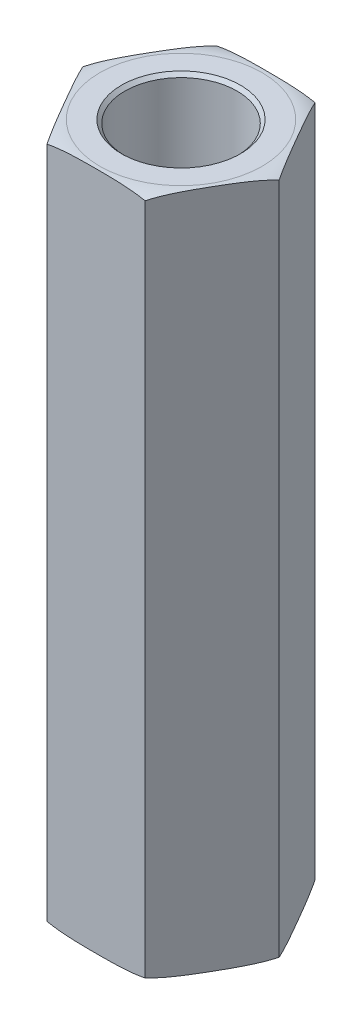
ISO-10303-21;
HEADER;
FILE_DESCRIPTION(('STEP AP214'),'2;1');
FILE_NAME('part.step','',(''),(''),'','','');
FILE_SCHEMA(('AUTOMOTIVE_DESIGN { 1 0 10303 214 1 1 1 1 }'));
ENDSEC;
DATA;
#1=APPLICATION_CONTEXT('core data for automotive mechanical design processes');
#2=APPLICATION_PROTOCOL_DEFINITION('international standard','automotive_design',2000,#1);
#3=PRODUCT_CONTEXT('',#1,'mechanical');
#4=PRODUCT('Part','Part','',(#3));
#5=PRODUCT_RELATED_PRODUCT_CATEGORY('part','',(#4));
#6=PRODUCT_DEFINITION_FORMATION('','',#4);
#7=PRODUCT_DEFINITION_CONTEXT('part definition',#1,'design');
#8=PRODUCT_DEFINITION('design','',#6,#7);
#9=PRODUCT_DEFINITION_SHAPE('','',#8);
#10=(LENGTH_UNIT() NAMED_UNIT(*) SI_UNIT(.MILLI.,.METRE.));
#11=(NAMED_UNIT(*) PLANE_ANGLE_UNIT() SI_UNIT($,.RADIAN.));
#12=(NAMED_UNIT(*) SI_UNIT($,.STERADIAN.) SOLID_ANGLE_UNIT());
#13=UNCERTAINTY_MEASURE_WITH_UNIT(LENGTH_MEASURE(1.E-05),#10,'distance_accuracy_value','');
#14=(GEOMETRIC_REPRESENTATION_CONTEXT(3) GLOBAL_UNCERTAINTY_ASSIGNED_CONTEXT((#13)) GLOBAL_UNIT_ASSIGNED_CONTEXT((#10,
#11,#12)) REPRESENTATION_CONTEXT('',''));
#15=CARTESIAN_POINT('',(0.,0.,0.));
#16=DIRECTION('',(0.,0.,1.));
#17=DIRECTION('',(1.,0.,0.));
#18=AXIS2_PLACEMENT_3D('',#15,#16,#17);
#19=CARTESIAN_POINT('',(3.66617420935412,12.7,0.));
#20=DIRECTION('',(-0.866025403784439,0.,0.5));
#21=DIRECTION('',(0.5,0.,0.866025403784439));
#22=AXIS2_PLACEMENT_3D('',#19,#20,#21);
#23=PLANE('',#22);
#24=DIRECTION('',(0.,1.,0.));
#25=VECTOR('',#24,1.);
#26=CARTESIAN_POINT('',(1.83308710467704,12.7,-3.175));
#27=LINE('',#26,#25);
#28=CARTESIAN_POINT('',(1.83308710467705,-12.573,-3.175));
#29=VERTEX_POINT('',#28);
#30=CARTESIAN_POINT('',(1.83308710467706,12.573,-3.175));
#31=VERTEX_POINT('',#30);
#32=EDGE_CURVE('E144',#29,#31,#27,.T.);
#33=ORIENTED_EDGE('',*,*,#32,.T.);
#34=CARTESIAN_POINT('',(3.66617420935412,12.573,0.));
#35=CARTESIAN_POINT('',(3.62797961467394,12.5889014148997,-0.0661549785605585));
#36=CARTESIAN_POINT('',(3.58956810864157,12.6024886076105,-0.132685658603878));
#37=CARTESIAN_POINT('',(3.5124905179571,12.6258161979402,-0.266187961794366));
#38=CARTESIAN_POINT('',(3.47382473049846,12.6355604771397,-0.333159070187399));
#39=CARTESIAN_POINT('',(3.39641631867872,12.6519966530451,-0.467234372392395));
#40=CARTESIAN_POINT('',(3.35767399633311,12.6586945328669,-0.534338043098201));
#41=CARTESIAN_POINT('',(3.28009834620112,12.6697767572932,-0.668703010557003));
#42=CARTESIAN_POINT('',(3.2412649958777,12.674160450474,-0.735964346345292));
#43=CARTESIAN_POINT('',(3.16354065964313,12.6812403004263,-0.870586845688127));
#44=CARTESIAN_POINT('',(3.12464965374474,12.6839355237591,-0.9379480438616));
#45=CARTESIAN_POINT('',(3.04685144594591,12.6881531983713,-1.07269849250698));
#46=CARTESIAN_POINT('',(3.00794424351967,12.6896756080272,-1.14008774388959));
#47=CARTESIAN_POINT('',(2.93051517598871,12.691922705889,-1.2741988228359));
#48=CARTESIAN_POINT('',(2.89199336248932,12.6926552468181,-1.34092056101654));
#49=CARTESIAN_POINT('',(2.8149477834614,12.6935767302574,-1.47436741839144));
#50=CARTESIAN_POINT('',(2.77642401791436,12.6937656658949,-1.5410925376178));
#51=CARTESIAN_POINT('',(2.69935964431009,12.6936659966806,-1.67457194815386));
#52=CARTESIAN_POINT('',(2.66081903631818,12.6933771811766,-1.74132623935045));
#53=CARTESIAN_POINT('',(2.58373908085326,12.692221986219,-1.87483263846084));
#54=CARTESIAN_POINT('',(2.54519973341241,12.6913555970386,-1.94158474631893));
#55=CARTESIAN_POINT('',(2.46812969629766,12.6887861940656,-2.0750739663429));
#56=CARTESIAN_POINT('',(2.42959900625961,12.6870832271617,-2.1418110791395));
#57=CARTESIAN_POINT('',(2.35255651340904,12.6824387229726,-2.27525259109845));
#58=CARTESIAN_POINT('',(2.31404470975438,12.6794972471358,-2.34195699171943));
#59=CARTESIAN_POINT('',(2.2508420623994,12.6732174124749,-2.45142718811111));
#60=CARTESIAN_POINT('',(2.22613849337005,12.6703980110463,-2.49421502479823));
#61=CARTESIAN_POINT('',(2.17676945272224,12.6638696794304,-2.57972471152118));
#62=CARTESIAN_POINT('',(2.1521039703418,12.6601610809139,-2.6224465801973));
#63=CARTESIAN_POINT('',(2.10282753811693,12.6516802711497,-2.7077958644265));
#64=CARTESIAN_POINT('',(2.07821657107526,12.6469084657008,-2.75042330976607));
#65=CARTESIAN_POINT('',(2.02900094683547,12.6360987712516,-2.8356672714756));
#66=CARTESIAN_POINT('',(2.00439646085461,12.6300577313084,-2.87828349128856));
#67=CARTESIAN_POINT('',(1.95527325900932,12.6165138354161,-2.96336737271507));
#68=CARTESIAN_POINT('',(1.93075459617613,12.609010197803,-3.00583494247581));
#69=CARTESIAN_POINT('',(1.8818215737317,12.5923203507084,-3.09058942351746));
#70=CARTESIAN_POINT('',(1.85740744053269,12.5831314978033,-3.13287594264091));
#71=CARTESIAN_POINT('',(1.83308710467706,12.573,-3.175));
#72=B_SPLINE_CURVE_WITH_KNOTS('',3,(#34,#35,#36,#37,#38,#39,#40,#41,#42,#43,#44,#45,#46,#47,#48,
#49,#50,#51,#52,#53,#54,#55,#56,#57,#58,#59,#60,#61,#62,#63,#64,#65,#66,#67,#68,#69,#70,#71),
.UNSPECIFIED.,.F.,.F.,(4,2,2,2,2,2,2,2,2,2,2,2,2,2,2,2,2,2,4),(0.,0.233977307817949,
0.467717675040708,0.700996973557522,0.934341903229779,1.16781571967243,1.40129782179829,
1.63243665809675,1.86357841666623,2.09482211846301,2.32606971471502,2.55730435147406,
2.78852751694422,2.93698369265095,3.0853845800448,3.23372892334589,3.38244598546616,
3.53124274626086,3.68027493713586),.UNSPECIFIED.);
#73=CARTESIAN_POINT('',(3.66617420935412,12.573,0.));
#74=VERTEX_POINT('',#73);
#75=EDGE_CURVE('E96',#74,#31,#72,.T.);
#76=ORIENTED_EDGE('',*,*,#75,.F.);
#77=DIRECTION('',(0.,1.,0.));
#78=VECTOR('',#77,1.);
#79=CARTESIAN_POINT('',(3.66617420935412,12.7,0.));
#80=LINE('',#79,#78);
#81=CARTESIAN_POINT('',(3.66617420935412,-12.573,0.));
#82=VERTEX_POINT('',#81);
#83=EDGE_CURVE('E146',#74,#82,#80,.F.);
#84=ORIENTED_EDGE('',*,*,#83,.T.);
#85=CARTESIAN_POINT('',(1.83308710467705,-12.573,-3.17500000000001));
#86=CARTESIAN_POINT('',(1.87128169935723,-12.5889014148997,-3.10884502143945));
#87=CARTESIAN_POINT('',(1.9096932053896,-12.6024886076105,-3.04231434139613));
#88=CARTESIAN_POINT('',(1.98677079607407,-12.6258161979402,-2.90881203820565));
#89=CARTESIAN_POINT('',(2.02543658353271,-12.6355604771397,-2.84184092981261));
#90=CARTESIAN_POINT('',(2.10284499535244,-12.6519966530451,-2.70776562760762));
#91=CARTESIAN_POINT('',(2.14158731769805,-12.6586945328669,-2.64066195690182));
#92=CARTESIAN_POINT('',(2.21916296783004,-12.6697767572932,-2.50629698944302));
#93=CARTESIAN_POINT('',(2.25799631815347,-12.674160450474,-2.43903565365473));
#94=CARTESIAN_POINT('',(2.33572065438803,-12.6812403004263,-2.3044131543119));
#95=CARTESIAN_POINT('',(2.37461166028642,-12.6839355237591,-2.23705195613842));
#96=CARTESIAN_POINT('',(2.45240986808525,-12.6881531983713,-2.10230150749305));
#97=CARTESIAN_POINT('',(2.49131707051149,-12.6896756080272,-2.03491225611044));
#98=CARTESIAN_POINT('',(2.56874613804245,-12.691922705889,-1.90080117716413));
#99=CARTESIAN_POINT('',(2.60726795154184,-12.6926552468181,-1.8340794389835));
#100=CARTESIAN_POINT('',(2.68431353056975,-12.6935767302574,-1.70063258160859));
#101=CARTESIAN_POINT('',(2.72283729611679,-12.6937656658949,-1.63390746238224));
#102=CARTESIAN_POINT('',(2.79990166972106,-12.6936659966806,-1.50042805184618));
#103=CARTESIAN_POINT('',(2.83844227771297,-12.6933771811766,-1.43367376064959));
#104=CARTESIAN_POINT('',(2.91552223317789,-12.692221986219,-1.30016736153921));
#105=CARTESIAN_POINT('',(2.95406158061874,-12.6913555970386,-1.23341525368111));
#106=CARTESIAN_POINT('',(3.03113161773348,-12.6887861940656,-1.09992603365715));
#107=CARTESIAN_POINT('',(3.06966230777154,-12.6870832271617,-1.03318892086055));
#108=CARTESIAN_POINT('',(3.14670480062211,-12.6824387229726,-0.899747408901607));
#109=CARTESIAN_POINT('',(3.18521660427677,-12.6794972471358,-0.833043008280621));
#110=CARTESIAN_POINT('',(3.24841925163175,-12.6732174124749,-0.723572811888938));
#111=CARTESIAN_POINT('',(3.27312282066109,-12.6703980110463,-0.680784975201824));
#112=CARTESIAN_POINT('',(3.32249186130891,-12.6638696794304,-0.595275288478867));
#113=CARTESIAN_POINT('',(3.34715734368935,-12.6601610809139,-0.552553419802744));
#114=CARTESIAN_POINT('',(3.39643377591423,-12.6516802711497,-0.467204135573539));
#115=CARTESIAN_POINT('',(3.4210447429559,-12.6469084657008,-0.424576690233965));
#116=CARTESIAN_POINT('',(3.47026036719569,-12.6360987712516,-0.339332728524428));
#117=CARTESIAN_POINT('',(3.49486485317655,-12.6300577313084,-0.296716508711459));
#118=CARTESIAN_POINT('',(3.54398805502185,-12.6165138354161,-0.211632627284942));
#119=CARTESIAN_POINT('',(3.56850671785504,-12.609010197803,-0.169165057524202));
#120=CARTESIAN_POINT('',(3.61743974029947,-12.5923203507084,-0.0844105764825456));
#121=CARTESIAN_POINT('',(3.64185387349848,-12.5831314978033,-0.0421240573590982));
#122=CARTESIAN_POINT('',(3.66617420935412,-12.573,0.));
#123=B_SPLINE_CURVE_WITH_KNOTS('',3,(#85,#86,#87,#88,#89,#90,#91,#92,#93,#94,#95,#96,#97,#98,
#99,#100,#101,#102,#103,#104,#105,#106,#107,#108,#109,#110,#111,#112,#113,#114,#115,#116,#117,
#118,#119,#120,#121,#122),.UNSPECIFIED.,.F.,.F.,(4,2,2,2,2,2,2,2,2,2,2,2,2,2,2,2,2,2,4),(0.,
0.233977307817944,0.467717675040699,0.700996973557508,0.934341903229761,1.16781571967241,
1.40129782179826,1.63243665809671,1.86357841666619,2.09482211846297,2.32606971471497,
2.55730435147401,2.78852751694416,2.9369836926509,3.08538458004476,3.23372892334587,
3.38244598546614,3.53124274626085,3.68027493713586),.UNSPECIFIED.);
#124=EDGE_CURVE('E224',#29,#82,#123,.T.);
#125=ORIENTED_EDGE('',*,*,#124,.F.);
#126=EDGE_LOOP('',(#33,#76,#84,#125));
#127=FACE_BOUND('',#126,.T.);
#128=ADVANCED_FACE('F16',(#127),#23,.F.);
#129=CARTESIAN_POINT('',(1.83308710467706,12.7,3.17499999999999));
#130=DIRECTION('',(-0.866025403784439,0.,-0.5));
#131=DIRECTION('',(-0.5,0.,0.866025403784439));
#132=AXIS2_PLACEMENT_3D('',#129,#130,#131);
#133=PLANE('',#132);
#134=ORIENTED_EDGE('',*,*,#83,.F.);
#135=CARTESIAN_POINT('',(1.83308710467706,12.573,3.17499999999999));
#136=CARTESIAN_POINT('',(1.87128169935724,12.5889014148997,3.10884502143943));
#137=CARTESIAN_POINT('',(1.90969320538962,12.6024886076105,3.04231434139611));
#138=CARTESIAN_POINT('',(1.98677079607408,12.6258161979402,2.90881203820562));
#139=CARTESIAN_POINT('',(2.02543658353273,12.6355604771397,2.84184092981259));
#140=CARTESIAN_POINT('',(2.10284499535246,12.6519966530451,2.7077656276076));
#141=CARTESIAN_POINT('',(2.14158731769807,12.6586945328669,2.64066195690179));
#142=CARTESIAN_POINT('',(2.21916296783006,12.6697767572932,2.50629698944299));
#143=CARTESIAN_POINT('',(2.25799631815349,12.674160450474,2.4390356536547));
#144=CARTESIAN_POINT('',(2.33572065438805,12.6812403004263,2.30441315431186));
#145=CARTESIAN_POINT('',(2.37461166028644,12.6839355237591,2.23705195613839));
#146=CARTESIAN_POINT('',(2.45240986808528,12.6881531983713,2.10230150749301));
#147=CARTESIAN_POINT('',(2.49131707051151,12.6896756080272,2.0349122561104));
#148=CARTESIAN_POINT('',(2.56874613804248,12.691922705889,1.90080117716409));
#149=CARTESIAN_POINT('',(2.60726795154187,12.6926552468181,1.83407943898345));
#150=CARTESIAN_POINT('',(2.68431353056978,12.6935767302574,1.70063258160855));
#151=CARTESIAN_POINT('',(2.72283729611682,12.6937656658949,1.63390746238219));
#152=CARTESIAN_POINT('',(2.79990166972109,12.6936659966806,1.50042805184613));
#153=CARTESIAN_POINT('',(2.83844227771301,12.6933771811766,1.43367376064954));
#154=CARTESIAN_POINT('',(2.91552223317792,12.692221986219,1.30016736153915));
#155=CARTESIAN_POINT('',(2.95406158061877,12.6913555970386,1.23341525368106));
#156=CARTESIAN_POINT('',(3.03113161773352,12.6887861940656,1.09992603365709));
#157=CARTESIAN_POINT('',(3.06966230777158,12.6870832271617,1.03318892086049));
#158=CARTESIAN_POINT('',(3.14670480062214,12.6824387229726,0.899747408901544));
#159=CARTESIAN_POINT('',(3.1852166042768,12.6794972471358,0.833043008280556));
#160=CARTESIAN_POINT('',(3.24841925163178,12.6732174124749,0.723572811888876));
#161=CARTESIAN_POINT('',(3.27312282066113,12.6703980110463,0.680784975201767));
#162=CARTESIAN_POINT('',(3.32249186130894,12.6638696794304,0.595275288478818));
#163=CARTESIAN_POINT('',(3.34715734368938,12.6601610809139,0.552553419802699));
#164=CARTESIAN_POINT('',(3.39643377591425,12.6516802711497,0.467204135573501));
#165=CARTESIAN_POINT('',(3.42104474295592,12.6469084657008,0.424576690233932));
#166=CARTESIAN_POINT('',(3.47026036719571,12.6360987712516,0.339332728524402));
#167=CARTESIAN_POINT('',(3.49486485317657,12.6300577313084,0.296716508711437));
#168=CARTESIAN_POINT('',(3.54398805502186,12.6165138354161,0.211632627284927));
#169=CARTESIAN_POINT('',(3.56850671785505,12.609010197803,0.169165057524192));
#170=CARTESIAN_POINT('',(3.61743974029947,12.5923203507084,0.0844105764825436));
#171=CARTESIAN_POINT('',(3.64185387349848,12.5831314978033,0.0421240573591002));
#172=CARTESIAN_POINT('',(3.66617420935412,12.573,0.));
#173=B_SPLINE_CURVE_WITH_KNOTS('',3,(#135,#136,#137,#138,#139,#140,#141,#142,#143,#144,#145,
#146,#147,#148,#149,#150,#151,#152,#153,#154,#155,#156,#157,#158,#159,#160,#161,#162,#163,#164,
#165,#166,#167,#168,#169,#170,#171,#172),.UNSPECIFIED.,.F.,.F.,(4,2,2,2,2,2,2,2,2,2,2,2,2,2,2,2,
2,2,4),(0.,0.23397730781795,0.467717675040709,0.700996973557522,0.93434190322978,
1.16781571967243,1.40129782179829,1.63243665809675,1.86357841666623,2.09482211846301,
2.32606971471502,2.55730435147406,2.78852751694422,2.93698369265095,3.08538458004479,
3.23372892334589,3.38244598546615,3.53124274626085,3.68027493713584),.UNSPECIFIED.);
#174=CARTESIAN_POINT('',(1.83308710467706,12.573,3.17499999999999));
#175=VERTEX_POINT('',#174);
#176=EDGE_CURVE('E217',#175,#74,#173,.T.);
#177=ORIENTED_EDGE('',*,*,#176,.F.);
#178=DIRECTION('',(0.,1.,0.));
#179=VECTOR('',#178,1.);
#180=CARTESIAN_POINT('',(1.83308710467706,12.7,3.17499999999999));
#181=LINE('',#180,#179);
#182=CARTESIAN_POINT('',(1.83308710467706,-12.573,3.17499999999999));
#183=VERTEX_POINT('',#182);
#184=EDGE_CURVE('E141',#175,#183,#181,.F.);
#185=ORIENTED_EDGE('',*,*,#184,.T.);
#186=CARTESIAN_POINT('',(3.66617420935412,-12.573,0.));
#187=CARTESIAN_POINT('',(3.62797961467394,-12.5889014148997,0.0661549785605638));
#188=CARTESIAN_POINT('',(3.58956810864156,-12.6024886076105,0.132685658603883));
#189=CARTESIAN_POINT('',(3.5124905179571,-12.6258161979402,0.266187961794371));
#190=CARTESIAN_POINT('',(3.47382473049846,-12.6355604771397,0.333159070187405));
#191=CARTESIAN_POINT('',(3.39641631867872,-12.6519966530451,0.467234372392401));
#192=CARTESIAN_POINT('',(3.35767399633311,-12.6586945328669,0.534338043098206));
#193=CARTESIAN_POINT('',(3.28009834620112,-12.6697767572932,0.668703010557008));
#194=CARTESIAN_POINT('',(3.2412649958777,-12.674160450474,0.735964346345298));
#195=CARTESIAN_POINT('',(3.16354065964313,-12.6812403004263,0.870586845688132));
#196=CARTESIAN_POINT('',(3.12464965374474,-12.6839355237591,0.937948043861606));
#197=CARTESIAN_POINT('',(3.0468514459459,-12.6881531983713,1.07269849250699));
#198=CARTESIAN_POINT('',(3.00794424351967,-12.6896756080272,1.1400877438896));
#199=CARTESIAN_POINT('',(2.9305151759887,-12.691922705889,1.27419882283591));
#200=CARTESIAN_POINT('',(2.89199336248931,-12.6926552468181,1.34092056101654));
#201=CARTESIAN_POINT('',(2.8149477834614,-12.6935767302574,1.47436741839145));
#202=CARTESIAN_POINT('',(2.77642401791436,-12.6937656658949,1.5410925376178));
#203=CARTESIAN_POINT('',(2.69935964431009,-12.6936659966806,1.67457194815387));
#204=CARTESIAN_POINT('',(2.66081903631818,-12.6933771811766,1.74132623935046));
#205=CARTESIAN_POINT('',(2.58373908085326,-12.692221986219,1.87483263846084));
#206=CARTESIAN_POINT('',(2.54519973341241,-12.6913555970386,1.94158474631894));
#207=CARTESIAN_POINT('',(2.46812969629766,-12.6887861940656,2.0750739663429));
#208=CARTESIAN_POINT('',(2.4295990062596,-12.6870832271616,2.14181107913951));
#209=CARTESIAN_POINT('',(2.35255651340904,-12.6824387229726,2.27525259109845));
#210=CARTESIAN_POINT('',(2.31404470975437,-12.6794972471358,2.34195699171944));
#211=CARTESIAN_POINT('',(2.2508420623994,-12.6732174124749,2.45142718811112));
#212=CARTESIAN_POINT('',(2.22613849337005,-12.6703980110463,2.49421502479823));
#213=CARTESIAN_POINT('',(2.17676945272224,-12.6638696794304,2.57972471152118));
#214=CARTESIAN_POINT('',(2.1521039703418,-12.6601610809139,2.6224465801973));
#215=CARTESIAN_POINT('',(2.10282753811693,-12.6516802711497,2.7077958644265));
#216=CARTESIAN_POINT('',(2.07821657107526,-12.6469084657008,2.75042330976606));
#217=CARTESIAN_POINT('',(2.02900094683548,-12.6360987712516,2.83566727147559));
#218=CARTESIAN_POINT('',(2.00439646085462,-12.6300577313084,2.87828349128856));
#219=CARTESIAN_POINT('',(1.95527325900932,-12.6165138354161,2.96336737271507));
#220=CARTESIAN_POINT('',(1.93075459617613,-12.609010197803,3.0058349424758));
#221=CARTESIAN_POINT('',(1.88182157373171,-12.5923203507084,3.09058942351745));
#222=CARTESIAN_POINT('',(1.8574074405327,-12.5831314978033,3.1328759426409));
#223=CARTESIAN_POINT('',(1.83308710467706,-12.573,3.17499999999999));
#224=B_SPLINE_CURVE_WITH_KNOTS('',3,(#186,#187,#188,#189,#190,#191,#192,#193,#194,#195,#196,
#197,#198,#199,#200,#201,#202,#203,#204,#205,#206,#207,#208,#209,#210,#211,#212,#213,#214,#215,
#216,#217,#218,#219,#220,#221,#222,#223),.UNSPECIFIED.,.F.,.F.,(4,2,2,2,2,2,2,2,2,2,2,2,2,2,2,2,
2,2,4),(0.,0.233977307817949,0.467717675040709,0.700996973557522,0.93434190322978,
1.16781571967243,1.40129782179829,1.63243665809675,1.86357841666623,2.09482211846301,
2.32606971471502,2.55730435147406,2.78852751694422,2.93698369265095,3.08538458004479,
3.23372892334589,3.38244598546615,3.53124274626085,3.68027493713584),.UNSPECIFIED.);
#225=EDGE_CURVE('E246',#82,#183,#224,.T.);
#226=ORIENTED_EDGE('',*,*,#225,.F.);
#227=EDGE_LOOP('',(#134,#177,#185,#226));
#228=FACE_BOUND('',#227,.T.);
#229=ADVANCED_FACE('F221',(#228),#133,.F.);
#230=CARTESIAN_POINT('',(1.83308710467706,12.7,-3.175));
#231=DIRECTION('',(0.,0.,1.));
#232=DIRECTION('',(1.,0.,0.));
#233=AXIS2_PLACEMENT_3D('',#230,#231,#232);
#234=PLANE('',#233);
#235=DIRECTION('',(0.,1.,0.));
#236=VECTOR('',#235,1.);
#237=CARTESIAN_POINT('',(-1.83308710467707,12.7,-3.175));
#238=LINE('',#237,#236);
#239=CARTESIAN_POINT('',(-1.83308710467707,-12.573,-3.175));
#240=VERTEX_POINT('',#239);
#241=CARTESIAN_POINT('',(-1.83308710467706,12.573,-3.17500000000001));
#242=VERTEX_POINT('',#241);
#243=EDGE_CURVE('E103',#240,#242,#238,.T.);
#244=ORIENTED_EDGE('',*,*,#243,.T.);
#245=CARTESIAN_POINT('',(1.83308710467706,12.573,-3.175));
#246=CARTESIAN_POINT('',(1.73237579828683,12.5939400141518,-3.175));
#247=CARTESIAN_POINT('',(1.63096506893486,12.6108853495327,-3.175));
#248=CARTESIAN_POINT('',(1.42767146651469,12.6384971643984,-3.175));
#249=CARTESIAN_POINT('',(1.32579191427254,12.6491875658753,-3.175));
#250=CARTESIAN_POINT('',(1.12177634709137,12.6661280408079,-3.175));
#251=CARTESIAN_POINT('',(1.0196405664338,12.6723812707189,-3.175));
#252=CARTESIAN_POINT('',(0.815663681397375,12.6819028064183,-3.175));
#253=CARTESIAN_POINT('',(0.713823115514573,12.6851834044999,-3.175));
#254=CARTESIAN_POINT('',(0.510018485441651,12.6899454848703,-3.175));
#255=CARTESIAN_POINT('',(0.408054390577976,12.6914254100882,-3.175));
#256=CARTESIAN_POINT('',(0.20406020033787,12.6933146818379,-3.175));
#257=CARTESIAN_POINT('',(0.102030100168935,12.6937234241492,-3.175));
#258=CARTESIAN_POINT('',(-0.102030100168934,12.6937234241492,-3.175));
#259=CARTESIAN_POINT('',(-0.204060200337869,12.6933146818379,-3.175));
#260=CARTESIAN_POINT('',(-0.408054390577974,12.6914254100882,-3.175));
#261=CARTESIAN_POINT('',(-0.510018485441649,12.6899454848703,-3.175));
#262=CARTESIAN_POINT('',(-0.71382311551457,12.6851834044999,-3.175));
#263=CARTESIAN_POINT('',(-0.815663681397372,12.6819028064183,-3.175));
#264=CARTESIAN_POINT('',(-1.01964056643379,12.6723812707189,-3.175));
#265=CARTESIAN_POINT('',(-1.12177634709137,12.6661280408079,-3.175));
#266=CARTESIAN_POINT('',(-1.32579191427253,12.6491875658753,-3.175));
#267=CARTESIAN_POINT('',(-1.42767146651468,12.6384971643984,-3.175));
#268=CARTESIAN_POINT('',(-1.63096506893485,12.6108853495327,-3.175));
#269=CARTESIAN_POINT('',(-1.73237579828682,12.5939400141518,-3.175));
#270=CARTESIAN_POINT('',(-1.83308710467705,12.573,-3.175));
#271=B_SPLINE_CURVE_WITH_KNOTS('',3,(#245,#246,#247,#248,#249,#250,#251,#252,#253,#254,#255,
#256,#257,#258,#259,#260,#261,#262,#263,#264,#265,#266,#267,#268,#269,#270),.UNSPECIFIED.,.F.,
.F.,(4,2,2,2,2,2,2,2,2,2,2,2,4),(0.,0.308333242342807,0.615479423308234,0.922406891130008,
1.2280592962085,1.53397581645216,1.84006485747889,2.14615389850561,2.45207041874927,
2.75772282382776,3.06465029164953,3.37179647261496,3.68012971495777),.UNSPECIFIED.);
#272=EDGE_CURVE('E88',#31,#242,#271,.T.);
#273=ORIENTED_EDGE('',*,*,#272,.F.);
#274=ORIENTED_EDGE('',*,*,#32,.F.);
#275=CARTESIAN_POINT('',(-1.83308710467707,-12.573,-3.175));
#276=CARTESIAN_POINT('',(-1.73237579828684,-12.5939400141518,-3.175));
#277=CARTESIAN_POINT('',(-1.63096506893487,-12.6108853495327,-3.175));
#278=CARTESIAN_POINT('',(-1.4276714665147,-12.6384971643984,-3.175));
#279=CARTESIAN_POINT('',(-1.32579191427255,-12.6491875658753,-3.175));
#280=CARTESIAN_POINT('',(-1.12177634709138,-12.6661280408079,-3.175));
#281=CARTESIAN_POINT('',(-1.0196405664338,-12.6723812707189,-3.175));
#282=CARTESIAN_POINT('',(-0.81566368139738,-12.6819028064183,-3.175));
#283=CARTESIAN_POINT('',(-0.713823115514577,-12.6851834044999,-3.175));
#284=CARTESIAN_POINT('',(-0.510018485441653,-12.6899454848703,-3.175));
#285=CARTESIAN_POINT('',(-0.408054390577979,-12.6914254100882,-3.175));
#286=CARTESIAN_POINT('',(-0.204060200337872,-12.6933146818379,-3.175));
#287=CARTESIAN_POINT('',(-0.102030100168936,-12.6937234241492,-3.175));
#288=CARTESIAN_POINT('',(0.102030100168934,-12.6937234241492,-3.175));
#289=CARTESIAN_POINT('',(0.204060200337868,-12.6933146818379,-3.175));
#290=CARTESIAN_POINT('',(0.408054390577973,-12.6914254100882,-3.175));
#291=CARTESIAN_POINT('',(0.510018485441647,-12.6899454848703,-3.175));
#292=CARTESIAN_POINT('',(0.713823115514568,-12.6851834044999,-3.175));
#293=CARTESIAN_POINT('',(0.81566368139737,-12.6819028064183,-3.175));
#294=CARTESIAN_POINT('',(1.01964056643379,-12.6723812707189,-3.175));
#295=CARTESIAN_POINT('',(1.12177634709137,-12.6661280408079,-3.175));
#296=CARTESIAN_POINT('',(1.32579191427253,-12.6491875658753,-3.175));
#297=CARTESIAN_POINT('',(1.42767146651468,-12.6384971643984,-3.175));
#298=CARTESIAN_POINT('',(1.63096506893485,-12.6108853495327,-3.175));
#299=CARTESIAN_POINT('',(1.73237579828682,-12.5939400141518,-3.175));
#300=CARTESIAN_POINT('',(1.83308710467705,-12.573,-3.175));
#301=B_SPLINE_CURVE_WITH_KNOTS('',3,(#275,#276,#277,#278,#279,#280,#281,#282,#283,#284,#285,
#286,#287,#288,#289,#290,#291,#292,#293,#294,#295,#296,#297,#298,#299,#300),.UNSPECIFIED.,.F.,
.F.,(4,2,2,2,2,2,2,2,2,2,2,2,4),(0.,0.308333242342808,0.615479423308238,0.922406891130013,
1.22805929620851,1.53397581645217,1.8400648574789,2.14615389850562,2.45207041874928,
2.75772282382777,3.06465029164954,3.37179647261497,3.68012971495777),.UNSPECIFIED.);
#302=EDGE_CURVE('E105',#240,#29,#301,.T.);
#303=ORIENTED_EDGE('',*,*,#302,.F.);
#304=EDGE_LOOP('',(#244,#273,#274,#303));
#305=FACE_BOUND('',#304,.T.);
#306=ADVANCED_FACE('F104',(#305),#234,.F.);
#307=CARTESIAN_POINT('',(-1.83308710467707,12.7,3.175));
#308=DIRECTION('',(0.,0.,-1.));
#309=DIRECTION('',(-1.,0.,0.));
#310=AXIS2_PLACEMENT_3D('',#307,#308,#309);
#311=PLANE('',#310);
#312=ORIENTED_EDGE('',*,*,#184,.F.);
#313=CARTESIAN_POINT('',(-1.83308710467706,12.573,3.175));
#314=CARTESIAN_POINT('',(-1.73237579828684,12.5939400141518,3.175));
#315=CARTESIAN_POINT('',(-1.63096506893486,12.6108853495327,3.175));
#316=CARTESIAN_POINT('',(-1.42767146651469,12.6384971643984,3.175));
#317=CARTESIAN_POINT('',(-1.32579191427254,12.6491875658753,3.175));
#318=CARTESIAN_POINT('',(-1.12177634709138,12.6661280408079,3.175));
#319=CARTESIAN_POINT('',(-1.0196405664338,12.6723812707189,3.175));
#320=CARTESIAN_POINT('',(-0.815663681397378,12.6819028064183,3.175));
#321=CARTESIAN_POINT('',(-0.713823115514575,12.6851834044999,3.175));
#322=CARTESIAN_POINT('',(-0.510018485441652,12.6899454848703,3.175));
#323=CARTESIAN_POINT('',(-0.408054390577977,12.6914254100882,3.175));
#324=CARTESIAN_POINT('',(-0.204060200337871,12.6933146818379,3.175));
#325=CARTESIAN_POINT('',(-0.102030100168935,12.6937234241492,3.17499999999999));
#326=CARTESIAN_POINT('',(0.102030100168935,12.6937234241492,3.17499999999999));
#327=CARTESIAN_POINT('',(0.204060200337871,12.6933146818379,3.17499999999999));
#328=CARTESIAN_POINT('',(0.408054390577978,12.6914254100882,3.17499999999999));
#329=CARTESIAN_POINT('',(0.510018485441652,12.6899454848703,3.17499999999999));
#330=CARTESIAN_POINT('',(0.713823115514575,12.6851834044999,3.17499999999999));
#331=CARTESIAN_POINT('',(0.815663681397378,12.6819028064183,3.17499999999999));
#332=CARTESIAN_POINT('',(1.0196405664338,12.6723812707189,3.17499999999999));
#333=CARTESIAN_POINT('',(1.12177634709138,12.6661280408079,3.17499999999999));
#334=CARTESIAN_POINT('',(1.32579191427254,12.6491875658753,3.17499999999999));
#335=CARTESIAN_POINT('',(1.42767146651469,12.6384971643984,3.17499999999999));
#336=CARTESIAN_POINT('',(1.63096506893486,12.6108853495327,3.17499999999999));
#337=CARTESIAN_POINT('',(1.73237579828684,12.5939400141518,3.17499999999999));
#338=CARTESIAN_POINT('',(1.83308710467706,12.573,3.17499999999999));
#339=B_SPLINE_CURVE_WITH_KNOTS('',3,(#313,#314,#315,#316,#317,#318,#319,#320,#321,#322,#323,
#324,#325,#326,#327,#328,#329,#330,#331,#332,#333,#334,#335,#336,#337,#338),.UNSPECIFIED.,.F.,
.F.,(4,2,2,2,2,2,2,2,2,2,2,2,4),(0.,0.308333242342808,0.615479423308237,0.922406891130011,
1.2280592962085,1.53397581645216,1.84006485747889,2.14615389850562,2.45207041874928,
2.75772282382777,3.06465029164955,3.37179647261498,3.68012971495779),.UNSPECIFIED.);
#340=CARTESIAN_POINT('',(-1.83308710467707,12.573,3.175));
#341=VERTEX_POINT('',#340);
#342=EDGE_CURVE('E99',#341,#175,#339,.T.);
#343=ORIENTED_EDGE('',*,*,#342,.F.);
#344=DIRECTION('',(0.,1.,0.));
#345=VECTOR('',#344,1.);
#346=CARTESIAN_POINT('',(-1.83308710467707,12.7,3.175));
#347=LINE('',#346,#345);
#348=CARTESIAN_POINT('',(-1.83308710467706,-12.573,3.175));
#349=VERTEX_POINT('',#348);
#350=EDGE_CURVE('E107',#341,#349,#347,.F.);
#351=ORIENTED_EDGE('',*,*,#350,.T.);
#352=CARTESIAN_POINT('',(1.83308710467706,-12.573,3.17499999999999));
#353=CARTESIAN_POINT('',(1.73237579828684,-12.5939400141518,3.17499999999999));
#354=CARTESIAN_POINT('',(1.63096506893486,-12.6108853495327,3.17499999999999));
#355=CARTESIAN_POINT('',(1.4276714665147,-12.6384971643984,3.17499999999999));
#356=CARTESIAN_POINT('',(1.32579191427254,-12.6491875658753,3.17499999999999));
#357=CARTESIAN_POINT('',(1.12177634709138,-12.6661280408079,3.17499999999999));
#358=CARTESIAN_POINT('',(1.0196405664338,-12.6723812707189,3.17499999999999));
#359=CARTESIAN_POINT('',(0.815663681397379,-12.6819028064183,3.17499999999999));
#360=CARTESIAN_POINT('',(0.713823115514576,-12.6851834044999,3.17499999999999));
#361=CARTESIAN_POINT('',(0.510018485441653,-12.6899454848703,3.17499999999999));
#362=CARTESIAN_POINT('',(0.408054390577978,-12.6914254100882,3.17499999999999));
#363=CARTESIAN_POINT('',(0.204060200337871,-12.6933146818379,3.17499999999999));
#364=CARTESIAN_POINT('',(0.102030100168935,-12.6937234241492,3.17499999999999));
#365=CARTESIAN_POINT('',(-0.102030100168935,-12.6937234241492,3.17499999999999));
#366=CARTESIAN_POINT('',(-0.204060200337871,-12.6933146818379,3.175));
#367=CARTESIAN_POINT('',(-0.408054390577977,-12.6914254100882,3.175));
#368=CARTESIAN_POINT('',(-0.510018485441652,-12.6899454848703,3.175));
#369=CARTESIAN_POINT('',(-0.713823115514575,-12.6851834044999,3.175));
#370=CARTESIAN_POINT('',(-0.815663681397377,-12.6819028064183,3.175));
#371=CARTESIAN_POINT('',(-1.0196405664338,-12.6723812707189,3.175));
#372=CARTESIAN_POINT('',(-1.12177634709138,-12.6661280408079,3.175));
#373=CARTESIAN_POINT('',(-1.32579191427254,-12.6491875658753,3.175));
#374=CARTESIAN_POINT('',(-1.42767146651469,-12.6384971643984,3.175));
#375=CARTESIAN_POINT('',(-1.63096506893486,-12.6108853495327,3.175));
#376=CARTESIAN_POINT('',(-1.73237579828684,-12.5939400141518,3.175));
#377=CARTESIAN_POINT('',(-1.83308710467706,-12.573,3.175));
#378=B_SPLINE_CURVE_WITH_KNOTS('',3,(#352,#353,#354,#355,#356,#357,#358,#359,#360,#361,#362,
#363,#364,#365,#366,#367,#368,#369,#370,#371,#372,#373,#374,#375,#376,#377),.UNSPECIFIED.,.F.,
.F.,(4,2,2,2,2,2,2,2,2,2,2,2,4),(0.,0.308333242342808,0.615479423308237,0.922406891130012,
1.22805929620851,1.53397581645217,1.84006485747889,2.14615389850562,2.45207041874928,
2.75772282382777,3.06465029164955,3.37179647261498,3.68012971495779),.UNSPECIFIED.);
#379=EDGE_CURVE('E211',#183,#349,#378,.T.);
#380=ORIENTED_EDGE('',*,*,#379,.F.);
#381=EDGE_LOOP('',(#312,#343,#351,#380));
#382=FACE_BOUND('',#381,.T.);
#383=ADVANCED_FACE('F379',(#382),#311,.F.);
#384=CARTESIAN_POINT('',(-3.66617420935413,12.7,0.));
#385=DIRECTION('',(0.866025403784439,0.,-0.499999999999999));
#386=DIRECTION('',(-0.499999999999999,0.,-0.866025403784439));
#387=AXIS2_PLACEMENT_3D('',#384,#385,#386);
#388=PLANE('',#387);
#389=ORIENTED_EDGE('',*,*,#350,.F.);
#390=CARTESIAN_POINT('',(-3.66617420935412,12.573,0.));
#391=CARTESIAN_POINT('',(-3.62797961467395,12.5889014148997,0.0661549785605641));
#392=CARTESIAN_POINT('',(-3.58956810864157,12.6024886076105,0.132685658603883));
#393=CARTESIAN_POINT('',(-3.51249051795711,12.6258161979402,0.266187961794371));
#394=CARTESIAN_POINT('',(-3.47382473049846,12.6355604771397,0.333159070187405));
#395=CARTESIAN_POINT('',(-3.39641631867873,12.6519966530451,0.4672343723924));
#396=CARTESIAN_POINT('',(-3.35767399633312,12.6586945328669,0.534338043098206));
#397=CARTESIAN_POINT('',(-3.28009834620112,12.6697767572932,0.668703010557008));
#398=CARTESIAN_POINT('',(-3.2412649958777,12.674160450474,0.735964346345298));
#399=CARTESIAN_POINT('',(-3.16354065964313,12.6812403004263,0.870586845688132));
#400=CARTESIAN_POINT('',(-3.12464965374474,12.6839355237591,0.937948043861606));
#401=CARTESIAN_POINT('',(-3.04685144594591,12.6881531983713,1.07269849250699));
#402=CARTESIAN_POINT('',(-3.00794424351967,12.6896756080272,1.1400877438896));
#403=CARTESIAN_POINT('',(-2.93051517598871,12.691922705889,1.27419882283591));
#404=CARTESIAN_POINT('',(-2.89199336248932,12.6926552468181,1.34092056101654));
#405=CARTESIAN_POINT('',(-2.81494778346141,12.6935767302574,1.47436741839145));
#406=CARTESIAN_POINT('',(-2.77642401791437,12.6937656658949,1.5410925376178));
#407=CARTESIAN_POINT('',(-2.69935964431009,12.6936659966806,1.67457194815387));
#408=CARTESIAN_POINT('',(-2.66081903631818,12.6933771811766,1.74132623935046));
#409=CARTESIAN_POINT('',(-2.58373908085326,12.692221986219,1.87483263846084));
#410=CARTESIAN_POINT('',(-2.54519973341242,12.6913555970386,1.94158474631894));
#411=CARTESIAN_POINT('',(-2.46812969629767,12.6887861940656,2.0750739663429));
#412=CARTESIAN_POINT('',(-2.42959900625961,12.6870832271616,2.1418110791395));
#413=CARTESIAN_POINT('',(-2.35255651340905,12.6824387229726,2.27525259109845));
#414=CARTESIAN_POINT('',(-2.31404470975439,12.6794972471358,2.34195699171944));
#415=CARTESIAN_POINT('',(-2.25084206239941,12.6732174124749,2.45142718811112));
#416=CARTESIAN_POINT('',(-2.22613849337006,12.6703980110463,2.49421502479823));
#417=CARTESIAN_POINT('',(-2.17676945272225,12.6638696794304,2.57972471152118));
#418=CARTESIAN_POINT('',(-2.15210397034181,12.6601610809139,2.6224465801973));
#419=CARTESIAN_POINT('',(-2.10282753811694,12.6516802711497,2.7077958644265));
#420=CARTESIAN_POINT('',(-2.07821657107527,12.6469084657008,2.75042330976607));
#421=CARTESIAN_POINT('',(-2.02900094683548,12.6360987712516,2.8356672714756));
#422=CARTESIAN_POINT('',(-2.00439646085462,12.6300577313084,2.87828349128856));
#423=CARTESIAN_POINT('',(-1.95527325900933,12.6165138354161,2.96336737271507));
#424=CARTESIAN_POINT('',(-1.93075459617614,12.609010197803,3.00583494247581));
#425=CARTESIAN_POINT('',(-1.88182157373171,12.5923203507084,3.09058942351746));
#426=CARTESIAN_POINT('',(-1.8574074405327,12.5831314978033,3.1328759426409));
#427=CARTESIAN_POINT('',(-1.83308710467707,12.573,3.175));
#428=B_SPLINE_CURVE_WITH_KNOTS('',3,(#390,#391,#392,#393,#394,#395,#396,#397,#398,#399,#400,
#401,#402,#403,#404,#405,#406,#407,#408,#409,#410,#411,#412,#413,#414,#415,#416,#417,#418,#419,
#420,#421,#422,#423,#424,#425,#426,#427),.UNSPECIFIED.,.F.,.F.,(4,2,2,2,2,2,2,2,2,2,2,2,2,2,2,2,
2,2,4),(0.,0.233977307817949,0.467717675040708,0.700996973557522,0.934341903229779,
1.16781571967243,1.40129782179829,1.63243665809675,1.86357841666623,2.09482211846301,
2.32606971471502,2.55730435147406,2.78852751694422,2.93698369265094,3.08538458004479,
3.23372892334589,3.38244598546615,3.53124274626085,3.68027493713584),.UNSPECIFIED.);
#429=CARTESIAN_POINT('',(-3.66617420935413,12.573,0.));
#430=VERTEX_POINT('',#429);
#431=EDGE_CURVE('E100',#430,#341,#428,.T.);
#432=ORIENTED_EDGE('',*,*,#431,.F.);
#433=DIRECTION('',(0.,1.,0.));
#434=VECTOR('',#433,1.);
#435=CARTESIAN_POINT('',(-3.66617420935413,12.7,0.));
#436=LINE('',#435,#434);
#437=CARTESIAN_POINT('',(-3.66617420935412,-12.573,0.));
#438=VERTEX_POINT('',#437);
#439=EDGE_CURVE('E82',#430,#438,#436,.F.);
#440=ORIENTED_EDGE('',*,*,#439,.T.);
#441=CARTESIAN_POINT('',(-1.83308710467707,-12.573,3.175));
#442=CARTESIAN_POINT('',(-1.87128169935724,-12.5889014148997,3.10884502143944));
#443=CARTESIAN_POINT('',(-1.90969320538962,-12.6024886076105,3.04231434139612));
#444=CARTESIAN_POINT('',(-1.98677079607408,-12.6258161979402,2.90881203820564));
#445=CARTESIAN_POINT('',(-2.02543658353272,-12.6355604771397,2.84184092981261));
#446=CARTESIAN_POINT('',(-2.10284499535246,-12.6519966530451,2.70776562760761));
#447=CARTESIAN_POINT('',(-2.14158731769807,-12.6586945328669,2.64066195690181));
#448=CARTESIAN_POINT('',(-2.21916296783006,-12.6697767572932,2.50629698944301));
#449=CARTESIAN_POINT('',(-2.25799631815348,-12.674160450474,2.43903565365472));
#450=CARTESIAN_POINT('',(-2.33572065438805,-12.6812403004263,2.30441315431189));
#451=CARTESIAN_POINT('',(-2.37461166028644,-12.6839355237591,2.23705195613841));
#452=CARTESIAN_POINT('',(-2.45240986808527,-12.6881531983713,2.10230150749304));
#453=CARTESIAN_POINT('',(-2.4913170705115,-12.6896756080272,2.03491225611043));
#454=CARTESIAN_POINT('',(-2.56874613804247,-12.691922705889,1.90080117716412));
#455=CARTESIAN_POINT('',(-2.60726795154185,-12.6926552468181,1.83407943898348));
#456=CARTESIAN_POINT('',(-2.68431353056976,-12.6935767302574,1.70063258160858));
#457=CARTESIAN_POINT('',(-2.72283729611681,-12.6937656658949,1.63390746238223));
#458=CARTESIAN_POINT('',(-2.79990166972108,-12.6936659966806,1.50042805184616));
#459=CARTESIAN_POINT('',(-2.83844227771299,-12.6933771811766,1.43367376064958));
#460=CARTESIAN_POINT('',(-2.91552223317791,-12.692221986219,1.30016736153919));
#461=CARTESIAN_POINT('',(-2.95406158061875,-12.6913555970386,1.2334152536811));
#462=CARTESIAN_POINT('',(-3.0311316177335,-12.6887861940656,1.09992603365714));
#463=CARTESIAN_POINT('',(-3.06966230777156,-12.6870832271617,1.03318892086054));
#464=CARTESIAN_POINT('',(-3.14670480062212,-12.6824387229726,0.899747408901591));
#465=CARTESIAN_POINT('',(-3.18521660427678,-12.6794972471358,0.833043008280605));
#466=CARTESIAN_POINT('',(-3.24841925163176,-12.6732174124749,0.723572811888922));
#467=CARTESIAN_POINT('',(-3.27312282066111,-12.6703980110463,0.68078497520181));
#468=CARTESIAN_POINT('',(-3.32249186130892,-12.6638696794304,0.595275288478856));
#469=CARTESIAN_POINT('',(-3.34715734368937,-12.6601610809139,0.552553419802734));
#470=CARTESIAN_POINT('',(-3.39643377591424,-12.6516802711497,0.467204135573531));
#471=CARTESIAN_POINT('',(-3.42104474295591,-12.6469084657008,0.424576690233959));
#472=CARTESIAN_POINT('',(-3.4702603671957,-12.6360987712516,0.339332728524424));
#473=CARTESIAN_POINT('',(-3.49486485317656,-12.6300577313084,0.296716508711456));
#474=CARTESIAN_POINT('',(-3.54398805502186,-12.6165138354161,0.211632627284941));
#475=CARTESIAN_POINT('',(-3.56850671785505,-12.609010197803,0.169165057524203));
#476=CARTESIAN_POINT('',(-3.61743974029947,-12.5923203507084,0.0844105764825489));
#477=CARTESIAN_POINT('',(-3.64185387349849,-12.5831314978033,0.0421240573591029));
#478=CARTESIAN_POINT('',(-3.66617420935412,-12.573,0.));
#479=B_SPLINE_CURVE_WITH_KNOTS('',3,(#441,#442,#443,#444,#445,#446,#447,#448,#449,#450,#451,
#452,#453,#454,#455,#456,#457,#458,#459,#460,#461,#462,#463,#464,#465,#466,#467,#468,#469,#470,
#471,#472,#473,#474,#475,#476,#477,#478),.UNSPECIFIED.,.F.,.F.,(4,2,2,2,2,2,2,2,2,2,2,2,2,2,2,2,
2,2,4),(0.,0.233977307817945,0.4677176750407,0.70099697355751,0.934341903229764,
1.16781571967241,1.40129782179827,1.63243665809672,1.8635784166662,2.09482211846297,
2.32606971471498,2.55730435147401,2.78852751694417,2.93698369265091,3.08538458004476,
3.23372892334587,3.38244598546614,3.53124274626084,3.68027493713585),.UNSPECIFIED.);
#480=EDGE_CURVE('E164',#349,#438,#479,.T.);
#481=ORIENTED_EDGE('',*,*,#480,.F.);
#482=EDGE_LOOP('',(#389,#432,#440,#481));
#483=FACE_BOUND('',#482,.T.);
#484=ADVANCED_FACE('F214',(#483),#388,.F.);
#485=CARTESIAN_POINT('',(-1.83308710467707,12.7,-3.175));
#486=DIRECTION('',(0.866025403784439,0.,0.5));
#487=DIRECTION('',(0.5,0.,-0.866025403784439));
#488=AXIS2_PLACEMENT_3D('',#485,#486,#487);
#489=PLANE('',#488);
#490=ORIENTED_EDGE('',*,*,#439,.F.);
#491=CARTESIAN_POINT('',(-1.83308710467706,12.573,-3.17500000000001));
#492=CARTESIAN_POINT('',(-1.87128169935723,12.5889014148997,-3.10884502143945));
#493=CARTESIAN_POINT('',(-1.90969320538961,12.6024886076105,-3.04231434139614));
#494=CARTESIAN_POINT('',(-1.98677079607407,12.6258161979402,-2.90881203820565));
#495=CARTESIAN_POINT('',(-2.02543658353272,12.6355604771397,-2.84184092981262));
#496=CARTESIAN_POINT('',(-2.10284499535245,12.6519966530451,-2.70776562760763));
#497=CARTESIAN_POINT('',(-2.14158731769806,12.6586945328669,-2.64066195690183));
#498=CARTESIAN_POINT('',(-2.21916296783005,12.6697767572932,-2.50629698944303));
#499=CARTESIAN_POINT('',(-2.25799631815347,12.674160450474,-2.43903565365474));
#500=CARTESIAN_POINT('',(-2.33572065438803,12.6812403004263,-2.30441315431191));
#501=CARTESIAN_POINT('',(-2.37461166028642,12.6839355237591,-2.23705195613844));
#502=CARTESIAN_POINT('',(-2.45240986808525,12.6881531983713,-2.10230150749306));
#503=CARTESIAN_POINT('',(-2.49131707051149,12.6896756080272,-2.03491225611046));
#504=CARTESIAN_POINT('',(-2.56874613804245,12.691922705889,-1.90080117716415));
#505=CARTESIAN_POINT('',(-2.60726795154184,12.6926552468181,-1.83407943898352));
#506=CARTESIAN_POINT('',(-2.68431353056975,12.6935767302574,-1.70063258160861));
#507=CARTESIAN_POINT('',(-2.72283729611679,12.6937656658949,-1.63390746238226));
#508=CARTESIAN_POINT('',(-2.79990166972106,12.6936659966806,-1.5004280518462));
#509=CARTESIAN_POINT('',(-2.83844227771297,12.6933771811766,-1.43367376064962));
#510=CARTESIAN_POINT('',(-2.91552223317789,12.692221986219,-1.30016736153923));
#511=CARTESIAN_POINT('',(-2.95406158061873,12.6913555970386,-1.23341525368114));
#512=CARTESIAN_POINT('',(-3.03113161773348,12.6887861940656,-1.09992603365718));
#513=CARTESIAN_POINT('',(-3.06966230777153,12.6870832271617,-1.03318892086058));
#514=CARTESIAN_POINT('',(-3.1467048006221,12.6824387229726,-0.899747408901638));
#515=CARTESIAN_POINT('',(-3.18521660427676,12.6794972471358,-0.833043008280652));
#516=CARTESIAN_POINT('',(-3.24841925163174,12.6732174124749,-0.723572811888968));
#517=CARTESIAN_POINT('',(-3.27312282066109,12.6703980110463,-0.680784975201853));
#518=CARTESIAN_POINT('',(-3.32249186130891,12.6638696794304,-0.595275288478892));
#519=CARTESIAN_POINT('',(-3.34715734368935,12.6601610809139,-0.552553419802768));
#520=CARTESIAN_POINT('',(-3.39643377591423,12.6516802711497,-0.46720413557356));
#521=CARTESIAN_POINT('',(-3.4210447429559,12.6469084657008,-0.424576690233985));
#522=CARTESIAN_POINT('',(-3.47026036719569,12.6360987712516,-0.339332728524444));
#523=CARTESIAN_POINT('',(-3.49486485317655,12.6300577313084,-0.296716508711473));
#524=CARTESIAN_POINT('',(-3.54398805502185,12.6165138354161,-0.211632627284952));
#525=CARTESIAN_POINT('',(-3.56850671785505,12.609010197803,-0.169165057524212));
#526=CARTESIAN_POINT('',(-3.61743974029948,12.5923203507084,-0.0844105764825525));
#527=CARTESIAN_POINT('',(-3.64185387349849,12.5831314978033,-0.0421240573591037));
#528=CARTESIAN_POINT('',(-3.66617420935413,12.573,0.));
#529=B_SPLINE_CURVE_WITH_KNOTS('',3,(#491,#492,#493,#494,#495,#496,#497,#498,#499,#500,#501,
#502,#503,#504,#505,#506,#507,#508,#509,#510,#511,#512,#513,#514,#515,#516,#517,#518,#519,#520,
#521,#522,#523,#524,#525,#526,#527,#528),.UNSPECIFIED.,.F.,.F.,(4,2,2,2,2,2,2,2,2,2,2,2,2,2,2,2,
2,2,4),(0.,0.233977307817942,0.467717675040693,0.7009969735575,0.93434190322975,1.1678157196724,
1.40129782179825,1.6324366580967,1.86357841666617,2.09482211846294,2.32606971471495,
2.55730435147398,2.78852751694413,2.93698369265088,3.08538458004474,3.23372892334585,
3.38244598546614,3.53124274626085,3.68027493713586),.UNSPECIFIED.);
#530=EDGE_CURVE('E93',#242,#430,#529,.T.);
#531=ORIENTED_EDGE('',*,*,#530,.F.);
#532=ORIENTED_EDGE('',*,*,#243,.F.);
#533=CARTESIAN_POINT('',(-3.66617420935413,-12.573,0.));
#534=CARTESIAN_POINT('',(-3.62797961467395,-12.5889014148997,-0.0661549785605611));
#535=CARTESIAN_POINT('',(-3.58956810864158,-12.6024886076105,-0.132685658603879));
#536=CARTESIAN_POINT('',(-3.51249051795711,-12.6258161979402,-0.266187961794366));
#537=CARTESIAN_POINT('',(-3.47382473049847,-12.6355604771397,-0.333159070187398));
#538=CARTESIAN_POINT('',(-3.39641631867874,-12.6519966530451,-0.467234372392392));
#539=CARTESIAN_POINT('',(-3.35767399633313,-12.6586945328669,-0.534338043098196));
#540=CARTESIAN_POINT('',(-3.28009834620113,-12.6697767572932,-0.668703010556996));
#541=CARTESIAN_POINT('',(-3.24126499587771,-12.674160450474,-0.735964346345285));
#542=CARTESIAN_POINT('',(-3.16354065964315,-12.6812403004263,-0.870586845688117));
#543=CARTESIAN_POINT('',(-3.12464965374476,-12.6839355237591,-0.93794804386159));
#544=CARTESIAN_POINT('',(-3.04685144594592,-12.6881531983713,-1.07269849250697));
#545=CARTESIAN_POINT('',(-3.00794424351969,-12.6896756080272,-1.14008774388958));
#546=CARTESIAN_POINT('',(-2.93051517598873,-12.691922705889,-1.27419882283589));
#547=CARTESIAN_POINT('',(-2.89199336248934,-12.6926552468181,-1.34092056101652));
#548=CARTESIAN_POINT('',(-2.81494778346143,-12.6935767302574,-1.47436741839142));
#549=CARTESIAN_POINT('',(-2.77642401791438,-12.6937656658949,-1.54109253761778));
#550=CARTESIAN_POINT('',(-2.69935964431011,-12.6936659966806,-1.67457194815384));
#551=CARTESIAN_POINT('',(-2.6608190363182,-12.6933771811766,-1.74132623935043));
#552=CARTESIAN_POINT('',(-2.58373908085328,-12.692221986219,-1.87483263846081));
#553=CARTESIAN_POINT('',(-2.54519973341244,-12.6913555970386,-1.94158474631891));
#554=CARTESIAN_POINT('',(-2.46812969629769,-12.6887861940656,-2.07507396634287));
#555=CARTESIAN_POINT('',(-2.42959900625963,-12.6870832271617,-2.14181107913947));
#556=CARTESIAN_POINT('',(-2.35255651340907,-12.6824387229726,-2.27525259109841));
#557=CARTESIAN_POINT('',(-2.31404470975441,-12.6794972471358,-2.3419569917194));
#558=CARTESIAN_POINT('',(-2.25084206239943,-12.6732174124749,-2.45142718811108));
#559=CARTESIAN_POINT('',(-2.22613849337008,-12.6703980110463,-2.4942150247982));
#560=CARTESIAN_POINT('',(-2.17676945272226,-12.6638696794304,-2.57972471152115));
#561=CARTESIAN_POINT('',(-2.15210397034182,-12.6601610809139,-2.62244658019727));
#562=CARTESIAN_POINT('',(-2.10282753811695,-12.6516802711497,-2.70779586442647));
#563=CARTESIAN_POINT('',(-2.07821657107528,-12.6469084657008,-2.75042330976605));
#564=CARTESIAN_POINT('',(-2.02900094683549,-12.6360987712516,-2.83566727147558));
#565=CARTESIAN_POINT('',(-2.00439646085463,-12.6300577313084,-2.87828349128855));
#566=CARTESIAN_POINT('',(-1.95527325900933,-12.6165138354161,-2.96336737271507));
#567=CARTESIAN_POINT('',(-1.93075459617614,-12.609010197803,-3.0058349424758));
#568=CARTESIAN_POINT('',(-1.88182157373172,-12.5923203507084,-3.09058942351746));
#569=CARTESIAN_POINT('',(-1.8574074405327,-12.5831314978033,-3.1328759426409));
#570=CARTESIAN_POINT('',(-1.83308710467707,-12.573,-3.175));
#571=B_SPLINE_CURVE_WITH_KNOTS('',3,(#533,#534,#535,#536,#537,#538,#539,#540,#541,#542,#543,
#544,#545,#546,#547,#548,#549,#550,#551,#552,#553,#554,#555,#556,#557,#558,#559,#560,#561,#562,
#563,#564,#565,#566,#567,#568,#569,#570),.UNSPECIFIED.,.F.,.F.,(4,2,2,2,2,2,2,2,2,2,2,2,2,2,2,2,
2,2,4),(0.,0.233977307817946,0.467717675040702,0.700996973557512,0.934341903229766,
1.16781571967242,1.40129782179827,1.63243665809672,1.8635784166662,2.09482211846298,
2.32606971471499,2.55730435147402,2.78852751694418,2.93698369265091,3.08538458004477,
3.23372892334587,3.38244598546614,3.53124274626085,3.68027493713585),.UNSPECIFIED.);
#572=EDGE_CURVE('E156',#438,#240,#571,.T.);
#573=ORIENTED_EDGE('',*,*,#572,.F.);
#574=EDGE_LOOP('',(#490,#531,#532,#573));
#575=FACE_BOUND('',#574,.T.);
#576=ADVANCED_FACE('F109',(#575),#489,.F.);
#577=CARTESIAN_POINT('',(0.,11.049,0.));
#578=DIRECTION('',(0.,1.,0.));
#579=DIRECTION('',(0.,0.,1.));
#580=AXIS2_PLACEMENT_3D('',#577,#578,#579);
#581=TOROIDAL_SURFACE('',#580,3.03117420935412,1.651);
#582=CARTESIAN_POINT('',(0.,12.7,0.));
#583=DIRECTION('',(0.,-1.,0.));
#584=DIRECTION('',(0.,0.,1.));
#585=AXIS2_PLACEMENT_3D('',#582,#583,#584);
#586=CIRCLE('',#585,3.03117420935412);
#587=CARTESIAN_POINT('',(0.,12.7,3.03117420935412));
#588=VERTEX_POINT('',#587);
#589=CARTESIAN_POINT('',(0.,12.7,-3.03117420935412));
#590=VERTEX_POINT('',#589);
#591=EDGE_CURVE('E163',#588,#590,#586,.T.);
#592=ORIENTED_EDGE('',*,*,#591,.T.);
#593=CARTESIAN_POINT('',(0.,12.7,0.));
#594=DIRECTION('',(0.,-1.,0.));
#595=DIRECTION('',(0.,0.,-1.));
#596=AXIS2_PLACEMENT_3D('',#593,#594,#595);
#597=CIRCLE('',#596,3.03117420935412);
#598=EDGE_CURVE('E200',#590,#588,#597,.T.);
#599=ORIENTED_EDGE('',*,*,#598,.T.);
#600=EDGE_LOOP('',(#592,#599));
#601=FACE_BOUND('',#600,.T.);
#602=ORIENTED_EDGE('',*,*,#176,.T.);
#603=ORIENTED_EDGE('',*,*,#75,.T.);
#604=ORIENTED_EDGE('',*,*,#272,.T.);
#605=ORIENTED_EDGE('',*,*,#530,.T.);
#606=ORIENTED_EDGE('',*,*,#431,.T.);
#607=ORIENTED_EDGE('',*,*,#342,.T.);
#608=EDGE_LOOP('',(#602,#603,#604,#605,#606,#607));
#609=FACE_BOUND('',#608,.T.);
#610=ADVANCED_FACE('F91',(#601,#609),#581,.T.);
#611=CARTESIAN_POINT('',(0.,-11.049,0.));
#612=DIRECTION('',(0.,-1.,0.));
#613=DIRECTION('',(0.,0.,1.));
#614=AXIS2_PLACEMENT_3D('',#611,#612,#613);
#615=TOROIDAL_SURFACE('',#614,3.03117420935412,1.651);
#616=CARTESIAN_POINT('',(0.,-12.7,0.));
#617=DIRECTION('',(0.,1.,0.));
#618=DIRECTION('',(0.,0.,1.));
#619=AXIS2_PLACEMENT_3D('',#616,#617,#618);
#620=CIRCLE('',#619,3.03117420935412);
#621=CARTESIAN_POINT('',(0.,-12.7,-3.03117420935412));
#622=VERTEX_POINT('',#621);
#623=CARTESIAN_POINT('',(0.,-12.7,3.03117420935412));
#624=VERTEX_POINT('',#623);
#625=EDGE_CURVE('E36',#622,#624,#620,.F.);
#626=ORIENTED_EDGE('',*,*,#625,.F.);
#627=CARTESIAN_POINT('',(0.,-12.7,0.));
#628=DIRECTION('',(0.,1.,0.));
#629=DIRECTION('',(0.,0.,-1.));
#630=AXIS2_PLACEMENT_3D('',#627,#628,#629);
#631=CIRCLE('',#630,3.03117420935412);
#632=EDGE_CURVE('E155',#624,#622,#631,.F.);
#633=ORIENTED_EDGE('',*,*,#632,.F.);
#634=EDGE_LOOP('',(#626,#633));
#635=FACE_BOUND('',#634,.T.);
#636=ORIENTED_EDGE('',*,*,#480,.T.);
#637=ORIENTED_EDGE('',*,*,#572,.T.);
#638=ORIENTED_EDGE('',*,*,#302,.T.);
#639=ORIENTED_EDGE('',*,*,#124,.T.);
#640=ORIENTED_EDGE('',*,*,#225,.T.);
#641=ORIENTED_EDGE('',*,*,#379,.T.);
#642=EDGE_LOOP('',(#636,#637,#638,#639,#640,#641));
#643=FACE_BOUND('',#642,.T.);
#644=ADVANCED_FACE('F170',(#635,#643),#615,.T.);
#645=CARTESIAN_POINT('',(-1.83308710467707,12.7,-3.175));
#646=DIRECTION('',(0.,-1.,0.));
#647=DIRECTION('',(0.,0.,-1.));
#648=AXIS2_PLACEMENT_3D('',#645,#646,#647);
#649=PLANE('',#648);
#650=ORIENTED_EDGE('',*,*,#591,.F.);
#651=ORIENTED_EDGE('',*,*,#598,.F.);
#652=EDGE_LOOP('',(#650,#651));
#653=FACE_BOUND('',#652,.T.);
#654=CARTESIAN_POINT('',(0.,12.6999999999953,0.));
#655=DIRECTION('',(0.,1.,0.));
#656=DIRECTION('',(-1.,0.,0.));
#657=AXIS2_PLACEMENT_3D('',#654,#655,#656);
#658=CIRCLE('',#657,2.22250000001623);
#659=CARTESIAN_POINT('',(-2.22250000001623,12.6999999999953,0.));
#660=VERTEX_POINT('',#659);
#661=EDGE_CURVE('E152',#660,#660,#658,.F.);
#662=ORIENTED_EDGE('',*,*,#661,.T.);
#663=EDGE_LOOP('',(#662));
#664=FACE_BOUND('',#663,.T.);
#665=ADVANCED_FACE('F175',(#653,#664),#649,.F.);
#666=CARTESIAN_POINT('',(-1.83308710467707,-12.7,-3.175));
#667=DIRECTION('',(0.,-1.,0.));
#668=DIRECTION('',(0.,0.,-1.));
#669=AXIS2_PLACEMENT_3D('',#666,#667,#668);
#670=PLANE('',#669);
#671=ORIENTED_EDGE('',*,*,#625,.T.);
#672=ORIENTED_EDGE('',*,*,#632,.T.);
#673=EDGE_LOOP('',(#671,#672));
#674=FACE_BOUND('',#673,.T.);
#675=CARTESIAN_POINT('',(0.,-12.6999999999953,0.));
#676=DIRECTION('',(0.,-1.,0.));
#677=DIRECTION('',(0.,0.,-1.));
#678=AXIS2_PLACEMENT_3D('',#675,#676,#677);
#679=CIRCLE('',#678,2.22250000001623);
#680=CARTESIAN_POINT('',(0.,-12.6999999999953,-2.22250000001623));
#681=VERTEX_POINT('',#680);
#682=EDGE_CURVE('E149',#681,#681,#679,.F.);
#683=ORIENTED_EDGE('',*,*,#682,.T.);
#684=EDGE_LOOP('',(#683));
#685=FACE_BOUND('',#684,.T.);
#686=ADVANCED_FACE('F204',(#674,#685),#670,.T.);
#687=CARTESIAN_POINT('',(0.,12.6999999999384,0.));
#688=DIRECTION('',(0.,1.,0.));
#689=DIRECTION('',(-1.,0.,0.));
#690=AXIS2_PLACEMENT_3D('',#687,#688,#689);
#691=CONICAL_SURFACE('',#690,2.22249999995938,0.785398163397448);
#692=ORIENTED_EDGE('',*,*,#661,.F.);
#693=EDGE_LOOP('',(#692));
#694=FACE_BOUND('',#693,.T.);
#695=CARTESIAN_POINT('',(0.,12.573,0.));
#696=DIRECTION('',(0.,1.,0.));
#697=DIRECTION('',(0.,0.,1.));
#698=AXIS2_PLACEMENT_3D('',#695,#696,#697);
#699=CIRCLE('',#698,2.0955);
#700=CARTESIAN_POINT('',(0.,12.573,2.0955));
#701=VERTEX_POINT('',#700);
#702=EDGE_CURVE('E28',#701,#701,#699,.F.);
#703=ORIENTED_EDGE('',*,*,#702,.T.);
#704=EDGE_LOOP('',(#703));
#705=FACE_BOUND('',#704,.T.);
#706=ADVANCED_FACE('F274',(#694,#705),#691,.F.);
#707=CARTESIAN_POINT('',(0.,-12.6999999999953,0.));
#708=DIRECTION('',(0.,-1.,0.));
#709=DIRECTION('',(0.,0.,-1.));
#710=AXIS2_PLACEMENT_3D('',#707,#708,#709);
#711=CONICAL_SURFACE('',#710,2.22250000001623,0.785398163397448);
#712=CARTESIAN_POINT('',(0.,-12.573,0.));
#713=DIRECTION('',(0.,1.,0.));
#714=DIRECTION('',(0.,0.,1.));
#715=AXIS2_PLACEMENT_3D('',#712,#713,#714);
#716=CIRCLE('',#715,2.0955);
#717=CARTESIAN_POINT('',(0.,-12.573,2.0955));
#718=VERTEX_POINT('',#717);
#719=EDGE_CURVE('E11',#718,#718,#716,.T.);
#720=ORIENTED_EDGE('',*,*,#719,.T.);
#721=EDGE_LOOP('',(#720));
#722=FACE_BOUND('',#721,.T.);
#723=ORIENTED_EDGE('',*,*,#682,.F.);
#724=EDGE_LOOP('',(#723));
#725=FACE_BOUND('',#724,.T.);
#726=ADVANCED_FACE('F268',(#722,#725),#711,.F.);
#727=CARTESIAN_POINT('',(0.,-12.7,0.));
#728=DIRECTION('',(0.,1.,0.));
#729=DIRECTION('',(0.,0.,1.));
#730=AXIS2_PLACEMENT_3D('',#727,#728,#729);
#731=CYLINDRICAL_SURFACE('',#730,2.0955);
#732=ORIENTED_EDGE('',*,*,#702,.F.);
#733=EDGE_LOOP('',(#732));
#734=FACE_BOUND('',#733,.T.);
#735=ORIENTED_EDGE('',*,*,#719,.F.);
#736=EDGE_LOOP('',(#735));
#737=FACE_BOUND('',#736,.T.);
#738=ADVANCED_FACE('F266',(#734,#737),#731,.F.);
#739=CLOSED_SHELL('',(#128,#229,#306,#383,#484,#576,#610,#644,#665,#686,#706,#726,#738));
#740=MANIFOLD_SOLID_BREP('B1',#739);
#741=ADVANCED_BREP_SHAPE_REPRESENTATION('',(#18,#740),#14);
#742=SHAPE_DEFINITION_REPRESENTATION(#9,#741);
ENDSEC;
END-ISO-10303-21;
